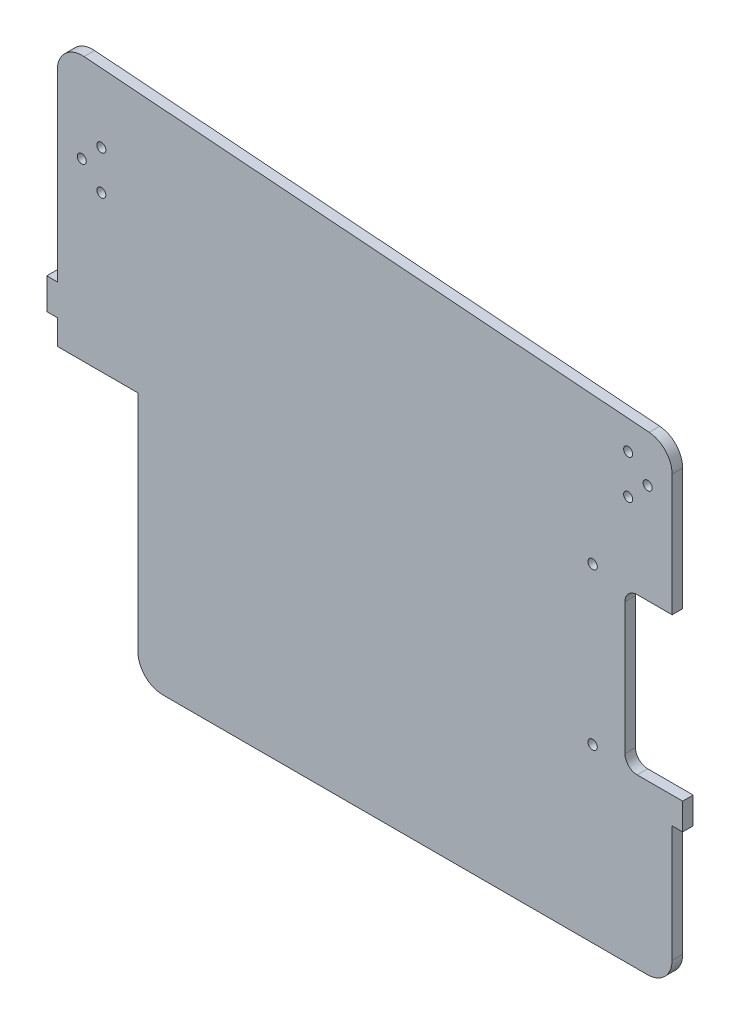
ISO-10303-21;
HEADER;
FILE_DESCRIPTION(('STEP AP214'),'2;1');
FILE_NAME('part.step','',(''),(''),'','','');
FILE_SCHEMA(('AUTOMOTIVE_DESIGN { 1 0 10303 214 1 1 1 1 }'));
ENDSEC;
DATA;
#1=APPLICATION_CONTEXT('core data for automotive mechanical design processes');
#2=APPLICATION_PROTOCOL_DEFINITION('international standard','automotive_design',2000,#1);
#3=PRODUCT_CONTEXT('',#1,'mechanical');
#4=PRODUCT('Part','Part','',(#3));
#5=PRODUCT_RELATED_PRODUCT_CATEGORY('part','',(#4));
#6=PRODUCT_DEFINITION_FORMATION('','',#4);
#7=PRODUCT_DEFINITION_CONTEXT('part definition',#1,'design');
#8=PRODUCT_DEFINITION('design','',#6,#7);
#9=PRODUCT_DEFINITION_SHAPE('','',#8);
#10=(LENGTH_UNIT() NAMED_UNIT(*) SI_UNIT(.MILLI.,.METRE.));
#11=(NAMED_UNIT(*) PLANE_ANGLE_UNIT() SI_UNIT($,.RADIAN.));
#12=(NAMED_UNIT(*) SI_UNIT($,.STERADIAN.) SOLID_ANGLE_UNIT());
#13=UNCERTAINTY_MEASURE_WITH_UNIT(LENGTH_MEASURE(1.E-05),#10,'distance_accuracy_value','');
#14=(GEOMETRIC_REPRESENTATION_CONTEXT(3) GLOBAL_UNCERTAINTY_ASSIGNED_CONTEXT((#13)) GLOBAL_UNIT_ASSIGNED_CONTEXT((#10,
#11,#12)) REPRESENTATION_CONTEXT('',''));
#15=CARTESIAN_POINT('',(0.,0.,0.));
#16=DIRECTION('',(0.,0.,1.));
#17=DIRECTION('',(1.,0.,0.));
#18=AXIS2_PLACEMENT_3D('',#15,#16,#17);
#19=CARTESIAN_POINT('',(-144.,0.,0.));
#20=DIRECTION('',(1.,0.,0.));
#21=DIRECTION('',(0.,0.,-1.));
#22=AXIS2_PLACEMENT_3D('',#19,#20,#21);
#23=PLANE('',#22);
#24=DIRECTION('',(0.,0.,1.));
#25=VECTOR('',#24,1.);
#26=CARTESIAN_POINT('',(-144.,-79.8196850776907,-17.7319898613351));
#27=LINE('',#26,#25);
#28=CARTESIAN_POINT('',(-144.,-79.8196850776907,-4.31799999999999));
#29=VERTEX_POINT('',#28);
#30=CARTESIAN_POINT('',(-144.,-79.8196850776907,0.));
#31=VERTEX_POINT('',#30);
#32=EDGE_CURVE('E221',#29,#31,#27,.T.);
#33=ORIENTED_EDGE('',*,*,#32,.F.);
#34=DIRECTION('',(0.,1.,0.));
#35=VECTOR('',#34,1.);
#36=CARTESIAN_POINT('',(-144.,-191.952333584363,-4.318));
#37=LINE('',#36,#35);
#38=CARTESIAN_POINT('',(-144.,-89.9796850776907,-4.318));
#39=VERTEX_POINT('',#38);
#40=EDGE_CURVE('E353',#39,#29,#37,.T.);
#41=ORIENTED_EDGE('',*,*,#40,.F.);
#42=DIRECTION('',(0.,0.,-1.));
#43=VECTOR('',#42,1.);
#44=CARTESIAN_POINT('',(-144.,-89.9796850776907,-4.318));
#45=LINE('',#44,#43);
#46=CARTESIAN_POINT('',(-144.,-89.9796850776907,0.));
#47=VERTEX_POINT('',#46);
#48=EDGE_CURVE('E322',#47,#39,#45,.T.);
#49=ORIENTED_EDGE('',*,*,#48,.F.);
#50=DIRECTION('',(0.,-1.,0.));
#51=VECTOR('',#50,1.);
#52=CARTESIAN_POINT('',(-144.,0.,0.));
#53=LINE('',#52,#51);
#54=EDGE_CURVE('E356',#31,#47,#53,.T.);
#55=ORIENTED_EDGE('',*,*,#54,.F.);
#56=EDGE_LOOP('',(#33,#41,#49,#55));
#57=FACE_BOUND('',#56,.T.);
#58=ADVANCED_FACE('F35',(#57),#23,.F.);
#59=CARTESIAN_POINT('',(107.682,0.,0.));
#60=DIRECTION('',(1.,0.,0.));
#61=DIRECTION('',(0.,0.,-1.));
#62=AXIS2_PLACEMENT_3D('',#59,#60,#61);
#63=PLANE('',#62);
#64=DIRECTION('',(0.,-1.,0.));
#65=VECTOR('',#64,1.);
#66=CARTESIAN_POINT('',(107.682,0.,0.));
#67=LINE('',#66,#65);
#68=CARTESIAN_POINT('',(107.682,-134.128741276363,0.));
#69=VERTEX_POINT('',#68);
#70=CARTESIAN_POINT('',(107.682,-181.792333584363,0.));
#71=VERTEX_POINT('',#70);
#72=EDGE_CURVE('E361',#69,#71,#67,.T.);
#73=ORIENTED_EDGE('',*,*,#72,.T.);
#74=DIRECTION('',(0.,0.,-1.));
#75=VECTOR('',#74,1.);
#76=CARTESIAN_POINT('',(107.682,-181.792333584363,-4.318));
#77=LINE('',#76,#75);
#78=CARTESIAN_POINT('',(107.682,-181.792333584363,-4.318));
#79=VERTEX_POINT('',#78);
#80=EDGE_CURVE('E12',#71,#79,#77,.T.);
#81=ORIENTED_EDGE('',*,*,#80,.T.);
#82=DIRECTION('',(0.,1.,0.));
#83=VECTOR('',#82,1.);
#84=CARTESIAN_POINT('',(107.682,-191.952333584363,-4.318));
#85=LINE('',#84,#83);
#86=CARTESIAN_POINT('',(107.682,-134.128741276363,-4.31799999999999));
#87=VERTEX_POINT('',#86);
#88=EDGE_CURVE('E359',#79,#87,#85,.T.);
#89=ORIENTED_EDGE('',*,*,#88,.T.);
#90=DIRECTION('',(0.,0.,1.));
#91=VECTOR('',#90,1.);
#92=CARTESIAN_POINT('',(107.682,-134.128741276363,-17.7319898613351));
#93=LINE('',#92,#91);
#94=EDGE_CURVE('E238',#87,#69,#93,.T.);
#95=ORIENTED_EDGE('',*,*,#94,.T.);
#96=EDGE_LOOP('',(#73,#81,#89,#95));
#97=FACE_BOUND('',#96,.T.);
#98=ADVANCED_FACE('F440',(#97),#63,.T.);
#99=CARTESIAN_POINT('',(107.682,-191.952333584363,0.));
#100=DIRECTION('',(0.,1.,0.));
#101=DIRECTION('',(0.,0.,1.));
#102=AXIS2_PLACEMENT_3D('',#99,#100,#101);
#103=PLANE('',#102);
#104=DIRECTION('',(-1.,0.,0.));
#105=VECTOR('',#104,1.);
#106=CARTESIAN_POINT('',(107.682,-191.952333584363,0.));
#107=LINE('',#106,#105);
#108=CARTESIAN_POINT('',(97.522,-191.952333584363,0.));
#109=VERTEX_POINT('',#108);
#110=CARTESIAN_POINT('',(-100.84,-191.952333584363,0.));
#111=VERTEX_POINT('',#110);
#112=EDGE_CURVE('E364',#109,#111,#107,.T.);
#113=ORIENTED_EDGE('',*,*,#112,.T.);
#114=DIRECTION('',(0.,0.,1.));
#115=VECTOR('',#114,1.);
#116=CARTESIAN_POINT('',(-100.84,-191.952333584363,0.));
#117=LINE('',#116,#115);
#118=CARTESIAN_POINT('',(-100.84,-191.952333584363,-4.318));
#119=VERTEX_POINT('',#118);
#120=EDGE_CURVE('E386',#111,#119,#117,.F.);
#121=ORIENTED_EDGE('',*,*,#120,.T.);
#122=DIRECTION('',(-1.,0.,0.));
#123=VECTOR('',#122,1.);
#124=CARTESIAN_POINT('',(107.682,-191.952333584363,-4.318));
#125=LINE('',#124,#123);
#126=CARTESIAN_POINT('',(97.522,-191.952333584363,-4.318));
#127=VERTEX_POINT('',#126);
#128=EDGE_CURVE('E367',#127,#119,#125,.T.);
#129=ORIENTED_EDGE('',*,*,#128,.F.);
#130=DIRECTION('',(0.,0.,-1.));
#131=VECTOR('',#130,1.);
#132=CARTESIAN_POINT('',(97.522,-191.952333584363,0.));
#133=LINE('',#132,#131);
#134=EDGE_CURVE('E384',#127,#109,#133,.F.);
#135=ORIENTED_EDGE('',*,*,#134,.T.);
#136=EDGE_LOOP('',(#113,#121,#129,#135));
#137=FACE_BOUND('',#136,.T.);
#138=ADVANCED_FACE('F448',(#137),#103,.F.);
#139=CARTESIAN_POINT('',(107.682,-191.952333584363,-4.318));
#140=DIRECTION('',(0.,0.,1.));
#141=DIRECTION('',(0.,-1.,0.));
#142=AXIS2_PLACEMENT_3D('',#139,#140,#141);
#143=PLANE('',#142);
#144=CARTESIAN_POINT('',(-134.,-18.4500000001085,-4.31799999999998));
#145=DIRECTION('',(0.,0.,1.));
#146=DIRECTION('',(0.,-1.,0.));
#147=AXIS2_PLACEMENT_3D('',#144,#145,#146);
#148=CIRCLE('',#147,1.85000000003173);
#149=CARTESIAN_POINT('',(-134.,-20.3000000001402,-4.31799999999998));
#150=VERTEX_POINT('',#149);
#151=EDGE_CURVE('E316',#150,#150,#148,.T.);
#152=ORIENTED_EDGE('',*,*,#151,.T.);
#153=EDGE_LOOP('',(#152));
#154=FACE_BOUND('',#153,.T.);
#155=CARTESIAN_POINT('',(-126.,-10.4500000001085,-4.31799999999998));
#156=DIRECTION('',(0.,0.,1.));
#157=DIRECTION('',(0.,-1.,0.));
#158=AXIS2_PLACEMENT_3D('',#155,#156,#157);
#159=CIRCLE('',#158,1.85000000003174);
#160=CARTESIAN_POINT('',(-126.,-12.3000000001402,-4.31799999999998));
#161=VERTEX_POINT('',#160);
#162=EDGE_CURVE('E313',#161,#161,#159,.T.);
#163=ORIENTED_EDGE('',*,*,#162,.T.);
#164=EDGE_LOOP('',(#163));
#165=FACE_BOUND('',#164,.T.);
#166=CARTESIAN_POINT('',(-126.,-26.4500000001085,-4.31799999999998));
#167=DIRECTION('',(0.,0.,1.));
#168=DIRECTION('',(0.,-1.,0.));
#169=AXIS2_PLACEMENT_3D('',#166,#167,#168);
#170=CIRCLE('',#169,1.85000000003171);
#171=CARTESIAN_POINT('',(-126.,-28.3000000001402,-4.31799999999998));
#172=VERTEX_POINT('',#171);
#173=EDGE_CURVE('E310',#172,#172,#170,.T.);
#174=ORIENTED_EDGE('',*,*,#173,.T.);
#175=EDGE_LOOP('',(#174));
#176=FACE_BOUND('',#175,.T.);
#177=CARTESIAN_POINT('',(89.682,-26.4500000001125,-4.31799999999998));
#178=DIRECTION('',(0.,0.,1.));
#179=DIRECTION('',(0.,-1.,0.));
#180=AXIS2_PLACEMENT_3D('',#177,#178,#179);
#181=CIRCLE('',#180,1.85000000002596);
#182=CARTESIAN_POINT('',(89.682,-28.3000000001384,-4.31799999999998));
#183=VERTEX_POINT('',#182);
#184=EDGE_CURVE('E307',#183,#183,#181,.T.);
#185=ORIENTED_EDGE('',*,*,#184,.T.);
#186=EDGE_LOOP('',(#185));
#187=FACE_BOUND('',#186,.T.);
#188=CARTESIAN_POINT('',(97.682,-18.4500000001125,-4.31799999999998));
#189=DIRECTION('',(0.,0.,1.));
#190=DIRECTION('',(0.,-1.,0.));
#191=AXIS2_PLACEMENT_3D('',#188,#189,#190);
#192=CIRCLE('',#191,1.85000000002596);
#193=CARTESIAN_POINT('',(97.682,-20.3000000001384,-4.31799999999998));
#194=VERTEX_POINT('',#193);
#195=EDGE_CURVE('E304',#194,#194,#192,.T.);
#196=ORIENTED_EDGE('',*,*,#195,.T.);
#197=EDGE_LOOP('',(#196));
#198=FACE_BOUND('',#197,.T.);
#199=CARTESIAN_POINT('',(89.682,-10.4500000001125,-4.31799999999998));
#200=DIRECTION('',(0.,0.,1.));
#201=DIRECTION('',(0.,-1.,0.));
#202=AXIS2_PLACEMENT_3D('',#199,#200,#201);
#203=CIRCLE('',#202,1.85000000002596);
#204=CARTESIAN_POINT('',(89.682,-12.3000000001384,-4.31799999999998));
#205=VERTEX_POINT('',#204);
#206=EDGE_CURVE('E301',#205,#205,#203,.T.);
#207=ORIENTED_EDGE('',*,*,#206,.T.);
#208=EDGE_LOOP('',(#207));
#209=FACE_BOUND('',#208,.T.);
#210=CARTESIAN_POINT('',(75.14500419,-121.586498411355,-4.318));
#211=DIRECTION('',(0.,0.,1.));
#212=DIRECTION('',(1.,0.,0.));
#213=AXIS2_PLACEMENT_3D('',#210,#211,#212);
#214=CIRCLE('',#213,1.90500000000001);
#215=CARTESIAN_POINT('',(77.05000419,-121.586498411355,-4.318));
#216=VERTEX_POINT('',#215);
#217=EDGE_CURVE('E341',#216,#216,#214,.T.);
#218=ORIENTED_EDGE('',*,*,#217,.T.);
#219=EDGE_LOOP('',(#218));
#220=FACE_BOUND('',#219,.T.);
#221=CARTESIAN_POINT('',(75.14500419,-57.5864984113548,-4.318));
#222=DIRECTION('',(0.,0.,1.));
#223=DIRECTION('',(1.,0.,0.));
#224=AXIS2_PLACEMENT_3D('',#221,#222,#223);
#225=CIRCLE('',#224,1.90500000000001);
#226=CARTESIAN_POINT('',(77.05000419,-57.5864984113548,-4.318));
#227=VERTEX_POINT('',#226);
#228=EDGE_CURVE('E347',#227,#227,#225,.T.);
#229=ORIENTED_EDGE('',*,*,#228,.T.);
#230=EDGE_LOOP('',(#229));
#231=FACE_BOUND('',#230,.T.);
#232=ORIENTED_EDGE('',*,*,#128,.T.);
#233=CARTESIAN_POINT('',(-100.84,-181.792333584363,-4.318));
#234=DIRECTION('',(0.,0.,1.));
#235=DIRECTION('',(0.,-1.,0.));
#236=AXIS2_PLACEMENT_3D('',#233,#234,#235);
#237=CIRCLE('',#236,10.16);
#238=CARTESIAN_POINT('',(-111.,-181.792333584363,-4.318));
#239=VERTEX_POINT('',#238);
#240=EDGE_CURVE('E393',#119,#239,#237,.F.);
#241=ORIENTED_EDGE('',*,*,#240,.T.);
#242=DIRECTION('',(0.,-1.,0.));
#243=VECTOR('',#242,1.);
#244=CARTESIAN_POINT('',(-111.,-191.952333584363,-4.318));
#245=LINE('',#244,#243);
#246=CARTESIAN_POINT('',(-111.,-89.9796850776907,-4.318));
#247=VERTEX_POINT('',#246);
#248=EDGE_CURVE('E325',#247,#239,#245,.T.);
#249=ORIENTED_EDGE('',*,*,#248,.F.);
#250=DIRECTION('',(-1.,0.,0.));
#251=VECTOR('',#250,1.);
#252=CARTESIAN_POINT('',(-111.,-89.9796850776907,-4.318));
#253=LINE('',#252,#251);
#254=EDGE_CURVE('E335',#247,#39,#253,.T.);
#255=ORIENTED_EDGE('',*,*,#254,.T.);
#256=ORIENTED_EDGE('',*,*,#40,.T.);
#257=DIRECTION('',(-1.,0.,0.));
#258=VECTOR('',#257,1.);
#259=CARTESIAN_POINT('',(-144.,-79.8196850776907,-4.31799999999999));
#260=LINE('',#259,#258);
#261=CARTESIAN_POINT('',(-148.318,-79.8196850776907,-4.31799999999999));
#262=VERTEX_POINT('',#261);
#263=EDGE_CURVE('E217',#29,#262,#260,.T.);
#264=ORIENTED_EDGE('',*,*,#263,.T.);
#265=DIRECTION('',(0.,1.,0.));
#266=VECTOR('',#265,1.);
#267=CARTESIAN_POINT('',(-148.318,-67.1196850776907,-4.31799999999998));
#268=LINE('',#267,#266);
#269=CARTESIAN_POINT('',(-148.318,-67.1196850776907,-4.31799999999998));
#270=VERTEX_POINT('',#269);
#271=EDGE_CURVE('E224',#262,#270,#268,.T.);
#272=ORIENTED_EDGE('',*,*,#271,.T.);
#273=DIRECTION('',(1.,0.,0.));
#274=VECTOR('',#273,1.);
#275=CARTESIAN_POINT('',(-144.,-67.1196850776907,-4.31799999999998));
#276=LINE('',#275,#274);
#277=CARTESIAN_POINT('',(-144.,-67.1196850776907,-4.31799999999998));
#278=VERTEX_POINT('',#277);
#279=EDGE_CURVE('E195',#270,#278,#276,.T.);
#280=ORIENTED_EDGE('',*,*,#279,.T.);
#281=CARTESIAN_POINT('',(-144.,8.09191974161541,-4.31799999999998));
#282=VERTEX_POINT('',#281);
#283=EDGE_CURVE('E350',#278,#282,#37,.T.);
#284=ORIENTED_EDGE('',*,*,#283,.T.);
#285=CARTESIAN_POINT('',(-133.84,8.09191974161547,-4.31799999999999));
#286=DIRECTION('',(0.,0.,1.));
#287=DIRECTION('',(0.,-1.,0.));
#288=AXIS2_PLACEMENT_3D('',#285,#286,#287);
#289=CIRCLE('',#288,10.16);
#290=CARTESIAN_POINT('',(-133.073175419792,18.2229404238167,-4.31799999999999));
#291=VERTEX_POINT('',#290);
#292=EDGE_CURVE('E391',#282,#291,#289,.F.);
#293=ORIENTED_EDGE('',*,*,#292,.T.);
#294=DIRECTION('',(0.997147704941064,-0.0754748602567045,0.));
#295=VECTOR('',#294,1.);
#296=CARTESIAN_POINT('',(107.682,-6.385536546433E-13,-4.31799999999999));
#297=LINE('',#296,#295);
#298=CARTESIAN_POINT('',(98.2888245802081,0.710976516981273,-4.31799999999999));
#299=VERTEX_POINT('',#298);
#300=EDGE_CURVE('E320',#291,#299,#297,.T.);
#301=ORIENTED_EDGE('',*,*,#300,.T.);
#302=CARTESIAN_POINT('',(97.522,-9.42004416521994,-4.31799999999998));
#303=DIRECTION('',(0.,0.,1.));
#304=DIRECTION('',(0.,-1.,0.));
#305=AXIS2_PLACEMENT_3D('',#302,#303,#304);
#306=CIRCLE('',#305,10.16);
#307=CARTESIAN_POINT('',(107.682,-9.42004416521999,-4.31799999999998));
#308=VERTEX_POINT('',#307);
#309=EDGE_CURVE('E50',#299,#308,#306,.F.);
#310=ORIENTED_EDGE('',*,*,#309,.T.);
#311=CARTESIAN_POINT('',(107.682,-59.3119246018148,-4.31799999999998));
#312=VERTEX_POINT('',#311);
#313=EDGE_CURVE('E358',#312,#308,#85,.T.);
#314=ORIENTED_EDGE('',*,*,#313,.F.);
#315=DIRECTION('',(-1.,0.,0.));
#316=VECTOR('',#315,1.);
#317=CARTESIAN_POINT('',(107.682,-59.3119246018148,-4.31799999999998));
#318=LINE('',#317,#316);
#319=CARTESIAN_POINT('',(93.378,-59.3119246018148,-4.31799999999998));
#320=VERTEX_POINT('',#319);
#321=EDGE_CURVE('E278',#312,#320,#318,.T.);
#322=ORIENTED_EDGE('',*,*,#321,.T.);
#323=CARTESIAN_POINT('',(93.378,-64.3119246018148,-4.31799999999998));
#324=DIRECTION('',(0.,0.,1.));
#325=DIRECTION('',(0.,-1.,0.));
#326=AXIS2_PLACEMENT_3D('',#323,#324,#325);
#327=CIRCLE('',#326,5.);
#328=CARTESIAN_POINT('',(88.378,-64.3119246018148,-4.31799999999999));
#329=VERTEX_POINT('',#328);
#330=EDGE_CURVE('E292',#320,#329,#327,.T.);
#331=ORIENTED_EDGE('',*,*,#330,.T.);
#332=DIRECTION('',(0.,-1.,0.));
#333=VECTOR('',#332,1.);
#334=CARTESIAN_POINT('',(88.378,-191.952333584363,-4.318));
#335=LINE('',#334,#333);
#336=CARTESIAN_POINT('',(88.378,-118.206741276363,-4.31799999999999));
#337=VERTEX_POINT('',#336);
#338=EDGE_CURVE('E295',#329,#337,#335,.T.);
#339=ORIENTED_EDGE('',*,*,#338,.T.);
#340=CARTESIAN_POINT('',(93.378,-118.206741276363,-4.31799999999999));
#341=DIRECTION('',(0.,0.,1.));
#342=DIRECTION('',(0.,-1.,0.));
#343=AXIS2_PLACEMENT_3D('',#340,#341,#342);
#344=CIRCLE('',#343,5.);
#345=CARTESIAN_POINT('',(93.378,-123.206741276363,-4.31799999999999));
#346=VERTEX_POINT('',#345);
#347=EDGE_CURVE('E298',#337,#346,#344,.T.);
#348=ORIENTED_EDGE('',*,*,#347,.T.);
#349=DIRECTION('',(1.,0.,0.));
#350=VECTOR('',#349,1.);
#351=CARTESIAN_POINT('',(107.682,-123.206741276363,-4.31799999999999));
#352=LINE('',#351,#350);
#353=CARTESIAN_POINT('',(112.,-123.206741276363,-4.31799999999999));
#354=VERTEX_POINT('',#353);
#355=EDGE_CURVE('E290',#346,#354,#352,.T.);
#356=ORIENTED_EDGE('',*,*,#355,.T.);
#357=DIRECTION('',(0.,-1.,0.));
#358=VECTOR('',#357,1.);
#359=CARTESIAN_POINT('',(112.,-123.206741276363,-4.31799999999999));
#360=LINE('',#359,#358);
#361=CARTESIAN_POINT('',(112.,-134.128741276363,-4.31799999999999));
#362=VERTEX_POINT('',#361);
#363=EDGE_CURVE('E229',#354,#362,#360,.T.);
#364=ORIENTED_EDGE('',*,*,#363,.T.);
#365=DIRECTION('',(-1.,0.,0.));
#366=VECTOR('',#365,1.);
#367=CARTESIAN_POINT('',(107.682,-134.128741276363,-4.31799999999999));
#368=LINE('',#367,#366);
#369=EDGE_CURVE('E231',#362,#87,#368,.T.);
#370=ORIENTED_EDGE('',*,*,#369,.T.);
#371=ORIENTED_EDGE('',*,*,#88,.F.);
#372=CARTESIAN_POINT('',(97.522,-181.792333584363,-4.318));
#373=DIRECTION('',(0.,0.,1.));
#374=DIRECTION('',(0.,-1.,0.));
#375=AXIS2_PLACEMENT_3D('',#372,#373,#374);
#376=CIRCLE('',#375,10.16);
#377=EDGE_CURVE('E388',#79,#127,#376,.F.);
#378=ORIENTED_EDGE('',*,*,#377,.T.);
#379=EDGE_LOOP('',(#232,#241,#249,#255,#256,#264,#272,#280,#284,#293,#301,#310,#314,#322,#331,
#339,#348,#356,#364,#370,#371,#378));
#380=FACE_BOUND('',#379,.T.);
#381=ADVANCED_FACE('F413',(#154,#165,#176,#187,#198,#209,#220,#231,#380),#143,.F.);
#382=CARTESIAN_POINT('',(107.682,0.,0.));
#383=DIRECTION('',(0.,0.,-1.));
#384=DIRECTION('',(0.,1.,0.));
#385=AXIS2_PLACEMENT_3D('',#382,#383,#384);
#386=PLANE('',#385);
#387=CARTESIAN_POINT('',(-134.,-18.4500000001085,0.));
#388=DIRECTION('',(0.,0.,1.));
#389=DIRECTION('',(1.,0.,0.));
#390=AXIS2_PLACEMENT_3D('',#387,#388,#389);
#391=CIRCLE('',#390,1.85000000003173);
#392=CARTESIAN_POINT('',(-132.149999999968,-18.4500000001085,0.));
#393=VERTEX_POINT('',#392);
#394=EDGE_CURVE('E247',#393,#393,#391,.T.);
#395=ORIENTED_EDGE('',*,*,#394,.F.);
#396=EDGE_LOOP('',(#395));
#397=FACE_BOUND('',#396,.T.);
#398=CARTESIAN_POINT('',(-126.,-10.4500000001085,0.));
#399=DIRECTION('',(0.,0.,1.));
#400=DIRECTION('',(1.,0.,0.));
#401=AXIS2_PLACEMENT_3D('',#398,#399,#400);
#402=CIRCLE('',#401,1.85000000003174);
#403=CARTESIAN_POINT('',(-124.149999999968,-10.4500000001085,0.));
#404=VERTEX_POINT('',#403);
#405=EDGE_CURVE('E255',#404,#404,#402,.T.);
#406=ORIENTED_EDGE('',*,*,#405,.F.);
#407=EDGE_LOOP('',(#406));
#408=FACE_BOUND('',#407,.T.);
#409=CARTESIAN_POINT('',(-126.,-26.4500000001085,0.));
#410=DIRECTION('',(0.,0.,1.));
#411=DIRECTION('',(1.,0.,0.));
#412=AXIS2_PLACEMENT_3D('',#409,#410,#411);
#413=CIRCLE('',#412,1.85000000003171);
#414=CARTESIAN_POINT('',(-124.149999999968,-26.4500000001085,0.));
#415=VERTEX_POINT('',#414);
#416=EDGE_CURVE('E252',#415,#415,#413,.T.);
#417=ORIENTED_EDGE('',*,*,#416,.F.);
#418=EDGE_LOOP('',(#417));
#419=FACE_BOUND('',#418,.T.);
#420=CARTESIAN_POINT('',(89.682,-26.4500000001125,0.));
#421=DIRECTION('',(0.,0.,1.));
#422=DIRECTION('',(1.,0.,0.));
#423=AXIS2_PLACEMENT_3D('',#420,#421,#422);
#424=CIRCLE('',#423,1.85000000002596);
#425=CARTESIAN_POINT('',(91.532000000026,-26.4500000001125,0.));
#426=VERTEX_POINT('',#425);
#427=EDGE_CURVE('E248',#426,#426,#424,.T.);
#428=ORIENTED_EDGE('',*,*,#427,.F.);
#429=EDGE_LOOP('',(#428));
#430=FACE_BOUND('',#429,.T.);
#431=CARTESIAN_POINT('',(97.682,-18.4500000001125,0.));
#432=DIRECTION('',(0.,0.,1.));
#433=DIRECTION('',(1.,0.,0.));
#434=AXIS2_PLACEMENT_3D('',#431,#432,#433);
#435=CIRCLE('',#434,1.85000000002596);
#436=CARTESIAN_POINT('',(99.532000000026,-18.4500000001125,0.));
#437=VERTEX_POINT('',#436);
#438=EDGE_CURVE('E251',#437,#437,#435,.T.);
#439=ORIENTED_EDGE('',*,*,#438,.F.);
#440=EDGE_LOOP('',(#439));
#441=FACE_BOUND('',#440,.T.);
#442=CARTESIAN_POINT('',(89.682,-10.4500000001125,0.));
#443=DIRECTION('',(0.,0.,1.));
#444=DIRECTION('',(1.,0.,0.));
#445=AXIS2_PLACEMENT_3D('',#442,#443,#444);
#446=CIRCLE('',#445,1.85000000002596);
#447=CARTESIAN_POINT('',(91.532000000026,-10.4500000001125,0.));
#448=VERTEX_POINT('',#447);
#449=EDGE_CURVE('E264',#448,#448,#446,.T.);
#450=ORIENTED_EDGE('',*,*,#449,.F.);
#451=EDGE_LOOP('',(#450));
#452=FACE_BOUND('',#451,.T.);
#453=CARTESIAN_POINT('',(75.14500419,-121.586498411355,0.));
#454=DIRECTION('',(0.,0.,1.));
#455=DIRECTION('',(1.,0.,0.));
#456=AXIS2_PLACEMENT_3D('',#453,#454,#455);
#457=CIRCLE('',#456,1.90500000000001);
#458=CARTESIAN_POINT('',(77.05000419,-121.586498411355,0.));
#459=VERTEX_POINT('',#458);
#460=EDGE_CURVE('E338',#459,#459,#457,.T.);
#461=ORIENTED_EDGE('',*,*,#460,.F.);
#462=EDGE_LOOP('',(#461));
#463=FACE_BOUND('',#462,.T.);
#464=CARTESIAN_POINT('',(75.14500419,-57.5864984113548,0.));
#465=DIRECTION('',(0.,0.,1.));
#466=DIRECTION('',(1.,0.,0.));
#467=AXIS2_PLACEMENT_3D('',#464,#465,#466);
#468=CIRCLE('',#467,1.90500000000001);
#469=CARTESIAN_POINT('',(77.05000419,-57.5864984113548,0.));
#470=VERTEX_POINT('',#469);
#471=EDGE_CURVE('E344',#470,#470,#468,.T.);
#472=ORIENTED_EDGE('',*,*,#471,.F.);
#473=EDGE_LOOP('',(#472));
#474=FACE_BOUND('',#473,.T.);
#475=DIRECTION('',(0.,1.,0.));
#476=VECTOR('',#475,1.);
#477=CARTESIAN_POINT('',(-111.,-191.952333584363,0.));
#478=LINE('',#477,#476);
#479=CARTESIAN_POINT('',(-111.,-181.792333584363,0.));
#480=VERTEX_POINT('',#479);
#481=CARTESIAN_POINT('',(-111.,-89.9796850776907,0.));
#482=VERTEX_POINT('',#481);
#483=EDGE_CURVE('E328',#480,#482,#478,.T.);
#484=ORIENTED_EDGE('',*,*,#483,.F.);
#485=CARTESIAN_POINT('',(-100.84,-181.792333584363,0.));
#486=DIRECTION('',(0.,0.,-1.));
#487=DIRECTION('',(0.,1.,0.));
#488=AXIS2_PLACEMENT_3D('',#485,#486,#487);
#489=CIRCLE('',#488,10.16);
#490=EDGE_CURVE('E382',#480,#111,#489,.F.);
#491=ORIENTED_EDGE('',*,*,#490,.T.);
#492=ORIENTED_EDGE('',*,*,#112,.F.);
#493=CARTESIAN_POINT('',(97.522,-181.792333584363,0.));
#494=DIRECTION('',(0.,0.,-1.));
#495=DIRECTION('',(0.,1.,0.));
#496=AXIS2_PLACEMENT_3D('',#493,#494,#495);
#497=CIRCLE('',#496,10.16);
#498=EDGE_CURVE('E376',#109,#71,#497,.F.);
#499=ORIENTED_EDGE('',*,*,#498,.T.);
#500=ORIENTED_EDGE('',*,*,#72,.F.);
#501=DIRECTION('',(1.,0.,0.));
#502=VECTOR('',#501,1.);
#503=CARTESIAN_POINT('',(107.682,-134.128741276363,0.));
#504=LINE('',#503,#502);
#505=CARTESIAN_POINT('',(112.,-134.128741276363,0.));
#506=VERTEX_POINT('',#505);
#507=EDGE_CURVE('E228',#69,#506,#504,.T.);
#508=ORIENTED_EDGE('',*,*,#507,.T.);
#509=DIRECTION('',(0.,1.,0.));
#510=VECTOR('',#509,1.);
#511=CARTESIAN_POINT('',(112.,-123.206741276363,0.));
#512=LINE('',#511,#510);
#513=CARTESIAN_POINT('',(112.,-123.206741276363,0.));
#514=VERTEX_POINT('',#513);
#515=EDGE_CURVE('E235',#506,#514,#512,.T.);
#516=ORIENTED_EDGE('',*,*,#515,.T.);
#517=DIRECTION('',(1.,0.,0.));
#518=VECTOR('',#517,1.);
#519=CARTESIAN_POINT('',(107.682,-123.206741276363,0.));
#520=LINE('',#519,#518);
#521=CARTESIAN_POINT('',(93.378,-123.206741276363,0.));
#522=VERTEX_POINT('',#521);
#523=EDGE_CURVE('E273',#522,#514,#520,.T.);
#524=ORIENTED_EDGE('',*,*,#523,.F.);
#525=CARTESIAN_POINT('',(93.378,-118.206741276363,0.));
#526=DIRECTION('',(0.,0.,1.));
#527=DIRECTION('',(-1.,0.,0.));
#528=AXIS2_PLACEMENT_3D('',#525,#526,#527);
#529=CIRCLE('',#528,5.);
#530=CARTESIAN_POINT('',(88.378,-118.206741276363,0.));
#531=VERTEX_POINT('',#530);
#532=EDGE_CURVE('E270',#531,#522,#529,.T.);
#533=ORIENTED_EDGE('',*,*,#532,.F.);
#534=DIRECTION('',(0.,-1.,0.));
#535=VECTOR('',#534,1.);
#536=CARTESIAN_POINT('',(88.378,-64.3119246018148,0.));
#537=LINE('',#536,#535);
#538=CARTESIAN_POINT('',(88.378,-64.3119246018148,0.));
#539=VERTEX_POINT('',#538);
#540=EDGE_CURVE('E267',#539,#531,#537,.T.);
#541=ORIENTED_EDGE('',*,*,#540,.F.);
#542=CARTESIAN_POINT('',(93.378,-64.3119246018148,0.));
#543=DIRECTION('',(0.,0.,1.));
#544=DIRECTION('',(1.,0.,0.));
#545=AXIS2_PLACEMENT_3D('',#542,#543,#544);
#546=CIRCLE('',#545,5.);
#547=CARTESIAN_POINT('',(93.378,-59.3119246018148,0.));
#548=VERTEX_POINT('',#547);
#549=EDGE_CURVE('E263',#548,#539,#546,.T.);
#550=ORIENTED_EDGE('',*,*,#549,.F.);
#551=DIRECTION('',(-1.,0.,0.));
#552=VECTOR('',#551,1.);
#553=CARTESIAN_POINT('',(107.682,-59.3119246018148,0.));
#554=LINE('',#553,#552);
#555=CARTESIAN_POINT('',(107.682,-59.3119246018148,0.));
#556=VERTEX_POINT('',#555);
#557=EDGE_CURVE('E260',#556,#548,#554,.T.);
#558=ORIENTED_EDGE('',*,*,#557,.F.);
#559=CARTESIAN_POINT('',(107.682,-9.42004416521994,0.));
#560=VERTEX_POINT('',#559);
#561=EDGE_CURVE('E362',#560,#556,#67,.T.);
#562=ORIENTED_EDGE('',*,*,#561,.F.);
#563=CARTESIAN_POINT('',(97.522,-9.42004416521994,0.));
#564=DIRECTION('',(0.,0.,-1.));
#565=DIRECTION('',(0.,1.,0.));
#566=AXIS2_PLACEMENT_3D('',#563,#564,#565);
#567=CIRCLE('',#566,10.16);
#568=CARTESIAN_POINT('',(98.2888245802081,0.710976516981273,0.));
#569=VERTEX_POINT('',#568);
#570=EDGE_CURVE('E378',#560,#569,#567,.F.);
#571=ORIENTED_EDGE('',*,*,#570,.T.);
#572=DIRECTION('',(-0.997147704941064,0.0754748602567045,0.));
#573=VECTOR('',#572,1.);
#574=CARTESIAN_POINT('',(107.682,-6.38378239159465E-13,0.));
#575=LINE('',#574,#573);
#576=CARTESIAN_POINT('',(-133.073175419792,18.2229404238167,0.));
#577=VERTEX_POINT('',#576);
#578=EDGE_CURVE('E319',#569,#577,#575,.T.);
#579=ORIENTED_EDGE('',*,*,#578,.T.);
#580=CARTESIAN_POINT('',(-133.84,8.09191974161547,0.));
#581=DIRECTION('',(0.,0.,-1.));
#582=DIRECTION('',(0.,1.,0.));
#583=AXIS2_PLACEMENT_3D('',#580,#581,#582);
#584=CIRCLE('',#583,10.16);
#585=CARTESIAN_POINT('',(-144.,8.09191974161547,0.));
#586=VERTEX_POINT('',#585);
#587=EDGE_CURVE('E380',#577,#586,#584,.F.);
#588=ORIENTED_EDGE('',*,*,#587,.T.);
#589=CARTESIAN_POINT('',(-144.,-67.1196850776907,0.));
#590=VERTEX_POINT('',#589);
#591=EDGE_CURVE('E213',#586,#590,#53,.T.);
#592=ORIENTED_EDGE('',*,*,#591,.T.);
#593=DIRECTION('',(-1.,0.,0.));
#594=VECTOR('',#593,1.);
#595=CARTESIAN_POINT('',(-144.,-67.1196850776907,0.));
#596=LINE('',#595,#594);
#597=CARTESIAN_POINT('',(-148.318,-67.1196850776907,0.));
#598=VERTEX_POINT('',#597);
#599=EDGE_CURVE('E193',#590,#598,#596,.T.);
#600=ORIENTED_EDGE('',*,*,#599,.T.);
#601=DIRECTION('',(0.,-1.,0.));
#602=VECTOR('',#601,1.);
#603=CARTESIAN_POINT('',(-148.318,-67.1196850776907,0.));
#604=LINE('',#603,#602);
#605=CARTESIAN_POINT('',(-148.318,-79.8196850776907,0.));
#606=VERTEX_POINT('',#605);
#607=EDGE_CURVE('E202',#598,#606,#604,.T.);
#608=ORIENTED_EDGE('',*,*,#607,.T.);
#609=DIRECTION('',(1.,0.,0.));
#610=VECTOR('',#609,1.);
#611=CARTESIAN_POINT('',(-144.,-79.8196850776907,0.));
#612=LINE('',#611,#610);
#613=EDGE_CURVE('E208',#606,#31,#612,.T.);
#614=ORIENTED_EDGE('',*,*,#613,.T.);
#615=ORIENTED_EDGE('',*,*,#54,.T.);
#616=DIRECTION('',(-1.,0.,0.));
#617=VECTOR('',#616,1.);
#618=CARTESIAN_POINT('',(-111.,-89.9796850776907,0.));
#619=LINE('',#618,#617);
#620=EDGE_CURVE('E333',#482,#47,#619,.T.);
#621=ORIENTED_EDGE('',*,*,#620,.F.);
#622=EDGE_LOOP('',(#484,#491,#492,#499,#500,#508,#516,#524,#533,#541,#550,#558,#562,#571,#579,
#588,#592,#600,#608,#614,#615,#621));
#623=FACE_BOUND('',#622,.T.);
#624=ADVANCED_FACE('F211',(#397,#408,#419,#430,#441,#452,#463,#474,#623),#386,.F.);
#625=ORIENTED_EDGE('',*,*,#313,.T.);
#626=DIRECTION('',(0.,0.,1.));
#627=VECTOR('',#626,1.);
#628=CARTESIAN_POINT('',(107.682,-9.42004416521994,0.));
#629=LINE('',#628,#627);
#630=EDGE_CURVE('E43',#308,#560,#629,.T.);
#631=ORIENTED_EDGE('',*,*,#630,.T.);
#632=ORIENTED_EDGE('',*,*,#561,.T.);
#633=DIRECTION('',(0.,0.,1.));
#634=VECTOR('',#633,1.);
#635=CARTESIAN_POINT('',(107.682,-59.3119246018148,0.));
#636=LINE('',#635,#634);
#637=EDGE_CURVE('E370',#312,#556,#636,.T.);
#638=ORIENTED_EDGE('',*,*,#637,.F.);
#639=EDGE_LOOP('',(#625,#631,#632,#638));
#640=FACE_BOUND('',#639,.T.);
#641=ADVANCED_FACE('F404',(#640),#63,.T.);
#642=ORIENTED_EDGE('',*,*,#591,.F.);
#643=DIRECTION('',(0.,0.,1.));
#644=VECTOR('',#643,1.);
#645=CARTESIAN_POINT('',(-144.,8.09191974161547,-4.31799999999999));
#646=LINE('',#645,#644);
#647=EDGE_CURVE('E399',#586,#282,#646,.F.);
#648=ORIENTED_EDGE('',*,*,#647,.T.);
#649=ORIENTED_EDGE('',*,*,#283,.F.);
#650=DIRECTION('',(0.,0.,1.));
#651=VECTOR('',#650,1.);
#652=CARTESIAN_POINT('',(-144.,-67.1196850776907,-17.7319898613351));
#653=LINE('',#652,#651);
#654=EDGE_CURVE('E199',#278,#590,#653,.T.);
#655=ORIENTED_EDGE('',*,*,#654,.T.);
#656=EDGE_LOOP('',(#642,#648,#649,#655));
#657=FACE_BOUND('',#656,.T.);
#658=ADVANCED_FACE('F471',(#657),#23,.F.);
#659=CARTESIAN_POINT('',(75.14500419,-57.5864984113548,-4.318));
#660=DIRECTION('',(0.,0.,1.));
#661=DIRECTION('',(1.,0.,0.));
#662=AXIS2_PLACEMENT_3D('',#659,#660,#661);
#663=CYLINDRICAL_SURFACE('',#662,1.90500000000001);
#664=ORIENTED_EDGE('',*,*,#228,.F.);
#665=EDGE_LOOP('',(#664));
#666=FACE_BOUND('',#665,.T.);
#667=ORIENTED_EDGE('',*,*,#471,.T.);
#668=EDGE_LOOP('',(#667));
#669=FACE_BOUND('',#668,.T.);
#670=ADVANCED_FACE('F492',(#666,#669),#663,.F.);
#671=CARTESIAN_POINT('',(75.14500419,-121.586498411355,-4.318));
#672=DIRECTION('',(0.,0.,1.));
#673=DIRECTION('',(1.,0.,0.));
#674=AXIS2_PLACEMENT_3D('',#671,#672,#673);
#675=CYLINDRICAL_SURFACE('',#674,1.90500000000001);
#676=ORIENTED_EDGE('',*,*,#217,.F.);
#677=EDGE_LOOP('',(#676));
#678=FACE_BOUND('',#677,.T.);
#679=ORIENTED_EDGE('',*,*,#460,.T.);
#680=EDGE_LOOP('',(#679));
#681=FACE_BOUND('',#680,.T.);
#682=ADVANCED_FACE('F497',(#678,#681),#675,.F.);
#683=CARTESIAN_POINT('',(-111.,-89.9796850776907,-4.318));
#684=DIRECTION('',(0.,1.,0.));
#685=DIRECTION('',(0.,0.,1.));
#686=AXIS2_PLACEMENT_3D('',#683,#684,#685);
#687=PLANE('',#686);
#688=ORIENTED_EDGE('',*,*,#48,.T.);
#689=ORIENTED_EDGE('',*,*,#254,.F.);
#690=DIRECTION('',(0.,0.,-1.));
#691=VECTOR('',#690,1.);
#692=CARTESIAN_POINT('',(-111.,-89.9796850776907,-4.318));
#693=LINE('',#692,#691);
#694=EDGE_CURVE('E330',#482,#247,#693,.T.);
#695=ORIENTED_EDGE('',*,*,#694,.F.);
#696=ORIENTED_EDGE('',*,*,#620,.T.);
#697=EDGE_LOOP('',(#688,#689,#695,#696));
#698=FACE_BOUND('',#697,.T.);
#699=ADVANCED_FACE('F461',(#698),#687,.F.);
#700=CARTESIAN_POINT('',(-111.,0.,0.));
#701=DIRECTION('',(1.,0.,0.));
#702=DIRECTION('',(0.,0.,-1.));
#703=AXIS2_PLACEMENT_3D('',#700,#701,#702);
#704=PLANE('',#703);
#705=ORIENTED_EDGE('',*,*,#248,.T.);
#706=DIRECTION('',(0.,0.,1.));
#707=VECTOR('',#706,1.);
#708=CARTESIAN_POINT('',(-111.,-181.792333584363,0.));
#709=LINE('',#708,#707);
#710=EDGE_CURVE('E373',#239,#480,#709,.T.);
#711=ORIENTED_EDGE('',*,*,#710,.T.);
#712=ORIENTED_EDGE('',*,*,#483,.T.);
#713=ORIENTED_EDGE('',*,*,#694,.T.);
#714=EDGE_LOOP('',(#705,#711,#712,#713));
#715=FACE_BOUND('',#714,.T.);
#716=ADVANCED_FACE('F457',(#715),#704,.F.);
#717=CARTESIAN_POINT('',(107.682,-6.38378239159465E-13,-256.719924762867));
#718=DIRECTION('',(0.0754748602567045,0.997147704941064,0.));
#719=DIRECTION('',(-0.997147704941064,0.0754748602567045,0.));
#720=AXIS2_PLACEMENT_3D('',#717,#718,#719);
#721=PLANE('',#720);
#722=ORIENTED_EDGE('',*,*,#300,.F.);
#723=DIRECTION('',(0.,0.,1.));
#724=VECTOR('',#723,1.);
#725=CARTESIAN_POINT('',(-133.073175419792,18.2229404238167,0.));
#726=LINE('',#725,#724);
#727=EDGE_CURVE('E396',#291,#577,#726,.T.);
#728=ORIENTED_EDGE('',*,*,#727,.T.);
#729=ORIENTED_EDGE('',*,*,#578,.F.);
#730=DIRECTION('',(0.,0.,1.));
#731=VECTOR('',#730,1.);
#732=CARTESIAN_POINT('',(98.2888245802081,0.710976516981273,-256.719924762867));
#733=LINE('',#732,#731);
#734=EDGE_CURVE('E58',#569,#299,#733,.F.);
#735=ORIENTED_EDGE('',*,*,#734,.T.);
#736=EDGE_LOOP('',(#722,#728,#729,#735));
#737=FACE_BOUND('',#736,.T.);
#738=ADVANCED_FACE('F476',(#737),#721,.T.);
#739=CARTESIAN_POINT('',(93.378,-118.206741276363,-5.08));
#740=DIRECTION('',(0.,0.,1.));
#741=DIRECTION('',(1.,0.,0.));
#742=AXIS2_PLACEMENT_3D('',#739,#740,#741);
#743=CYLINDRICAL_SURFACE('',#742,5.);
#744=DIRECTION('',(0.,0.,1.));
#745=VECTOR('',#744,1.);
#746=CARTESIAN_POINT('',(88.378,-118.206741276363,-5.08));
#747=LINE('',#746,#745);
#748=EDGE_CURVE('E279',#337,#531,#747,.T.);
#749=ORIENTED_EDGE('',*,*,#748,.T.);
#750=ORIENTED_EDGE('',*,*,#532,.T.);
#751=DIRECTION('',(0.,0.,1.));
#752=VECTOR('',#751,1.);
#753=CARTESIAN_POINT('',(93.378,-123.206741276363,-5.08));
#754=LINE('',#753,#752);
#755=EDGE_CURVE('E276',#346,#522,#754,.T.);
#756=ORIENTED_EDGE('',*,*,#755,.F.);
#757=ORIENTED_EDGE('',*,*,#347,.F.);
#758=EDGE_LOOP('',(#749,#750,#756,#757));
#759=FACE_BOUND('',#758,.T.);
#760=ADVANCED_FACE('F422',(#759),#743,.F.);
#761=CARTESIAN_POINT('',(88.378,-64.3119246018148,-5.08));
#762=DIRECTION('',(-1.,0.,0.));
#763=DIRECTION('',(0.,0.,1.));
#764=AXIS2_PLACEMENT_3D('',#761,#762,#763);
#765=PLANE('',#764);
#766=DIRECTION('',(0.,0.,1.));
#767=VECTOR('',#766,1.);
#768=CARTESIAN_POINT('',(88.378,-64.3119246018148,-5.08));
#769=LINE('',#768,#767);
#770=EDGE_CURVE('E281',#329,#539,#769,.T.);
#771=ORIENTED_EDGE('',*,*,#770,.T.);
#772=ORIENTED_EDGE('',*,*,#540,.T.);
#773=ORIENTED_EDGE('',*,*,#748,.F.);
#774=ORIENTED_EDGE('',*,*,#338,.F.);
#775=EDGE_LOOP('',(#771,#772,#773,#774));
#776=FACE_BOUND('',#775,.T.);
#777=ADVANCED_FACE('F418',(#776),#765,.F.);
#778=CARTESIAN_POINT('',(93.378,-64.3119246018148,-5.08));
#779=DIRECTION('',(0.,0.,1.));
#780=DIRECTION('',(1.,0.,0.));
#781=AXIS2_PLACEMENT_3D('',#778,#779,#780);
#782=CYLINDRICAL_SURFACE('',#781,5.);
#783=DIRECTION('',(0.,0.,1.));
#784=VECTOR('',#783,1.);
#785=CARTESIAN_POINT('',(93.378,-59.3119246018148,-5.08));
#786=LINE('',#785,#784);
#787=EDGE_CURVE('E275',#320,#548,#786,.T.);
#788=ORIENTED_EDGE('',*,*,#787,.T.);
#789=ORIENTED_EDGE('',*,*,#549,.T.);
#790=ORIENTED_EDGE('',*,*,#770,.F.);
#791=ORIENTED_EDGE('',*,*,#330,.F.);
#792=EDGE_LOOP('',(#788,#789,#790,#791));
#793=FACE_BOUND('',#792,.T.);
#794=ADVANCED_FACE('F416',(#793),#782,.F.);
#795=CARTESIAN_POINT('',(107.682,-123.206741276363,-5.08));
#796=DIRECTION('',(0.,-1.,0.));
#797=DIRECTION('',(0.,0.,-1.));
#798=AXIS2_PLACEMENT_3D('',#795,#796,#797);
#799=PLANE('',#798);
#800=ORIENTED_EDGE('',*,*,#755,.T.);
#801=ORIENTED_EDGE('',*,*,#523,.T.);
#802=DIRECTION('',(0.,0.,1.));
#803=VECTOR('',#802,1.);
#804=CARTESIAN_POINT('',(112.,-123.206741276363,-17.7319898613351));
#805=LINE('',#804,#803);
#806=EDGE_CURVE('E232',#354,#514,#805,.T.);
#807=ORIENTED_EDGE('',*,*,#806,.F.);
#808=ORIENTED_EDGE('',*,*,#355,.F.);
#809=EDGE_LOOP('',(#800,#801,#807,#808));
#810=FACE_BOUND('',#809,.T.);
#811=ADVANCED_FACE('F433',(#810),#799,.F.);
#812=CARTESIAN_POINT('',(107.682,-59.3119246018148,-5.08));
#813=DIRECTION('',(0.,1.,0.));
#814=DIRECTION('',(0.,0.,1.));
#815=AXIS2_PLACEMENT_3D('',#812,#813,#814);
#816=PLANE('',#815);
#817=ORIENTED_EDGE('',*,*,#637,.T.);
#818=ORIENTED_EDGE('',*,*,#557,.T.);
#819=ORIENTED_EDGE('',*,*,#787,.F.);
#820=ORIENTED_EDGE('',*,*,#321,.F.);
#821=EDGE_LOOP('',(#817,#818,#819,#820));
#822=FACE_BOUND('',#821,.T.);
#823=ADVANCED_FACE('F412',(#822),#816,.F.);
#824=CARTESIAN_POINT('',(89.682,-10.4500000001125,-5.08));
#825=DIRECTION('',(0.,0.,1.));
#826=DIRECTION('',(1.,0.,0.));
#827=AXIS2_PLACEMENT_3D('',#824,#825,#826);
#828=CYLINDRICAL_SURFACE('',#827,1.85000000002596);
#829=ORIENTED_EDGE('',*,*,#449,.T.);
#830=EDGE_LOOP('',(#829));
#831=FACE_BOUND('',#830,.T.);
#832=ORIENTED_EDGE('',*,*,#206,.F.);
#833=EDGE_LOOP('',(#832));
#834=FACE_BOUND('',#833,.T.);
#835=ADVANCED_FACE('F552',(#831,#834),#828,.F.);
#836=CARTESIAN_POINT('',(97.682,-18.4500000001125,-5.08));
#837=DIRECTION('',(0.,0.,1.));
#838=DIRECTION('',(1.,0.,0.));
#839=AXIS2_PLACEMENT_3D('',#836,#837,#838);
#840=CYLINDRICAL_SURFACE('',#839,1.85000000002596);
#841=ORIENTED_EDGE('',*,*,#438,.T.);
#842=EDGE_LOOP('',(#841));
#843=FACE_BOUND('',#842,.T.);
#844=ORIENTED_EDGE('',*,*,#195,.F.);
#845=EDGE_LOOP('',(#844));
#846=FACE_BOUND('',#845,.T.);
#847=ADVANCED_FACE('F530',(#843,#846),#840,.F.);
#848=CARTESIAN_POINT('',(89.682,-26.4500000001125,-5.08));
#849=DIRECTION('',(0.,0.,1.));
#850=DIRECTION('',(1.,0.,0.));
#851=AXIS2_PLACEMENT_3D('',#848,#849,#850);
#852=CYLINDRICAL_SURFACE('',#851,1.85000000002596);
#853=ORIENTED_EDGE('',*,*,#427,.T.);
#854=EDGE_LOOP('',(#853));
#855=FACE_BOUND('',#854,.T.);
#856=ORIENTED_EDGE('',*,*,#184,.F.);
#857=EDGE_LOOP('',(#856));
#858=FACE_BOUND('',#857,.T.);
#859=ADVANCED_FACE('F526',(#855,#858),#852,.F.);
#860=CARTESIAN_POINT('',(-126.,-26.4500000001085,-5.08));
#861=DIRECTION('',(0.,0.,1.));
#862=DIRECTION('',(1.,0.,0.));
#863=AXIS2_PLACEMENT_3D('',#860,#861,#862);
#864=CYLINDRICAL_SURFACE('',#863,1.85000000003171);
#865=ORIENTED_EDGE('',*,*,#416,.T.);
#866=EDGE_LOOP('',(#865));
#867=FACE_BOUND('',#866,.T.);
#868=ORIENTED_EDGE('',*,*,#173,.F.);
#869=EDGE_LOOP('',(#868));
#870=FACE_BOUND('',#869,.T.);
#871=ADVANCED_FACE('F529',(#867,#870),#864,.F.);
#872=CARTESIAN_POINT('',(-126.,-10.4500000001085,-5.08));
#873=DIRECTION('',(0.,0.,1.));
#874=DIRECTION('',(1.,0.,0.));
#875=AXIS2_PLACEMENT_3D('',#872,#873,#874);
#876=CYLINDRICAL_SURFACE('',#875,1.85000000003174);
#877=ORIENTED_EDGE('',*,*,#405,.T.);
#878=EDGE_LOOP('',(#877));
#879=FACE_BOUND('',#878,.T.);
#880=ORIENTED_EDGE('',*,*,#162,.F.);
#881=EDGE_LOOP('',(#880));
#882=FACE_BOUND('',#881,.T.);
#883=ADVANCED_FACE('F534',(#879,#882),#876,.F.);
#884=CARTESIAN_POINT('',(-134.,-18.4500000001085,-5.08));
#885=DIRECTION('',(0.,0.,1.));
#886=DIRECTION('',(1.,0.,0.));
#887=AXIS2_PLACEMENT_3D('',#884,#885,#886);
#888=CYLINDRICAL_SURFACE('',#887,1.85000000003173);
#889=ORIENTED_EDGE('',*,*,#394,.T.);
#890=EDGE_LOOP('',(#889));
#891=FACE_BOUND('',#890,.T.);
#892=ORIENTED_EDGE('',*,*,#151,.F.);
#893=EDGE_LOOP('',(#892));
#894=FACE_BOUND('',#893,.T.);
#895=ADVANCED_FACE('F523',(#891,#894),#888,.F.);
#896=CARTESIAN_POINT('',(112.,-123.206741276363,-17.7319898613351));
#897=DIRECTION('',(1.,0.,0.));
#898=DIRECTION('',(0.,0.,-1.));
#899=AXIS2_PLACEMENT_3D('',#896,#897,#898);
#900=PLANE('',#899);
#901=ORIENTED_EDGE('',*,*,#363,.F.);
#902=ORIENTED_EDGE('',*,*,#806,.T.);
#903=ORIENTED_EDGE('',*,*,#515,.F.);
#904=DIRECTION('',(0.,0.,1.));
#905=VECTOR('',#904,1.);
#906=CARTESIAN_POINT('',(112.,-134.128741276363,-17.7319898613351));
#907=LINE('',#906,#905);
#908=EDGE_CURVE('E241',#362,#506,#907,.T.);
#909=ORIENTED_EDGE('',*,*,#908,.F.);
#910=EDGE_LOOP('',(#901,#902,#903,#909));
#911=FACE_BOUND('',#910,.T.);
#912=ADVANCED_FACE('F430',(#911),#900,.T.);
#913=CARTESIAN_POINT('',(107.682,-134.128741276363,-17.7319898613351));
#914=DIRECTION('',(0.,-1.,0.));
#915=DIRECTION('',(0.,0.,-1.));
#916=AXIS2_PLACEMENT_3D('',#913,#914,#915);
#917=PLANE('',#916);
#918=ORIENTED_EDGE('',*,*,#369,.F.);
#919=ORIENTED_EDGE('',*,*,#908,.T.);
#920=ORIENTED_EDGE('',*,*,#507,.F.);
#921=ORIENTED_EDGE('',*,*,#94,.F.);
#922=EDGE_LOOP('',(#918,#919,#920,#921));
#923=FACE_BOUND('',#922,.T.);
#924=ADVANCED_FACE('F438',(#923),#917,.T.);
#925=CARTESIAN_POINT('',(-144.,-79.8196850776907,-17.7319898613351));
#926=DIRECTION('',(0.,-1.,0.));
#927=DIRECTION('',(0.,0.,-1.));
#928=AXIS2_PLACEMENT_3D('',#925,#926,#927);
#929=PLANE('',#928);
#930=ORIENTED_EDGE('',*,*,#263,.F.);
#931=ORIENTED_EDGE('',*,*,#32,.T.);
#932=ORIENTED_EDGE('',*,*,#613,.F.);
#933=DIRECTION('',(0.,0.,1.));
#934=VECTOR('',#933,1.);
#935=CARTESIAN_POINT('',(-148.318,-79.8196850776907,-17.7319898613351));
#936=LINE('',#935,#934);
#937=EDGE_CURVE('E198',#262,#606,#936,.T.);
#938=ORIENTED_EDGE('',*,*,#937,.F.);
#939=EDGE_LOOP('',(#930,#931,#932,#938));
#940=FACE_BOUND('',#939,.T.);
#941=ADVANCED_FACE('F467',(#940),#929,.T.);
#942=CARTESIAN_POINT('',(-148.318,-67.1196850776907,-17.7319898613351));
#943=DIRECTION('',(-1.,0.,0.));
#944=DIRECTION('',(0.,0.,1.));
#945=AXIS2_PLACEMENT_3D('',#942,#943,#944);
#946=PLANE('',#945);
#947=ORIENTED_EDGE('',*,*,#271,.F.);
#948=ORIENTED_EDGE('',*,*,#937,.T.);
#949=ORIENTED_EDGE('',*,*,#607,.F.);
#950=DIRECTION('',(0.,0.,1.));
#951=VECTOR('',#950,1.);
#952=CARTESIAN_POINT('',(-148.318,-67.1196850776907,-17.7319898613351));
#953=LINE('',#952,#951);
#954=EDGE_CURVE('E188',#270,#598,#953,.T.);
#955=ORIENTED_EDGE('',*,*,#954,.F.);
#956=EDGE_LOOP('',(#947,#948,#949,#955));
#957=FACE_BOUND('',#956,.T.);
#958=ADVANCED_FACE('F203',(#957),#946,.T.);
#959=CARTESIAN_POINT('',(-144.,-67.1196850776907,-17.7319898613351));
#960=DIRECTION('',(0.,1.,0.));
#961=DIRECTION('',(0.,0.,1.));
#962=AXIS2_PLACEMENT_3D('',#959,#960,#961);
#963=PLANE('',#962);
#964=ORIENTED_EDGE('',*,*,#279,.F.);
#965=ORIENTED_EDGE('',*,*,#954,.T.);
#966=ORIENTED_EDGE('',*,*,#599,.F.);
#967=ORIENTED_EDGE('',*,*,#654,.F.);
#968=EDGE_LOOP('',(#964,#965,#966,#967));
#969=FACE_BOUND('',#968,.T.);
#970=ADVANCED_FACE('F190',(#969),#963,.T.);
#971=CARTESIAN_POINT('',(-100.84,-181.792333584363,0.));
#972=DIRECTION('',(0.,0.,1.));
#973=DIRECTION('',(1.,0.,0.));
#974=AXIS2_PLACEMENT_3D('',#971,#972,#973);
#975=CYLINDRICAL_SURFACE('',#974,10.16);
#976=ORIENTED_EDGE('',*,*,#240,.F.);
#977=ORIENTED_EDGE('',*,*,#120,.F.);
#978=ORIENTED_EDGE('',*,*,#490,.F.);
#979=ORIENTED_EDGE('',*,*,#710,.F.);
#980=EDGE_LOOP('',(#976,#977,#978,#979));
#981=FACE_BOUND('',#980,.T.);
#982=ADVANCED_FACE('F453',(#981),#975,.T.);
#983=CARTESIAN_POINT('',(-133.84,8.09191974161547,-256.719924762867));
#984=DIRECTION('',(0.,0.,-1.));
#985=DIRECTION('',(-1.,0.,0.));
#986=AXIS2_PLACEMENT_3D('',#983,#984,#985);
#987=CYLINDRICAL_SURFACE('',#986,10.16);
#988=ORIENTED_EDGE('',*,*,#292,.F.);
#989=ORIENTED_EDGE('',*,*,#647,.F.);
#990=ORIENTED_EDGE('',*,*,#587,.F.);
#991=ORIENTED_EDGE('',*,*,#727,.F.);
#992=EDGE_LOOP('',(#988,#989,#990,#991));
#993=FACE_BOUND('',#992,.T.);
#994=ADVANCED_FACE('F474',(#993),#987,.T.);
#995=CARTESIAN_POINT('',(97.522,-9.42004416521994,0.));
#996=DIRECTION('',(0.,0.,1.));
#997=DIRECTION('',(1.,0.,0.));
#998=AXIS2_PLACEMENT_3D('',#995,#996,#997);
#999=CYLINDRICAL_SURFACE('',#998,10.16);
#1000=ORIENTED_EDGE('',*,*,#309,.F.);
#1001=ORIENTED_EDGE('',*,*,#734,.F.);
#1002=ORIENTED_EDGE('',*,*,#570,.F.);
#1003=ORIENTED_EDGE('',*,*,#630,.F.);
#1004=EDGE_LOOP('',(#1000,#1001,#1002,#1003));
#1005=FACE_BOUND('',#1004,.T.);
#1006=ADVANCED_FACE('F477',(#1005),#999,.T.);
#1007=CARTESIAN_POINT('',(97.522,-181.792333584363,0.));
#1008=DIRECTION('',(0.,0.,1.));
#1009=DIRECTION('',(1.,0.,0.));
#1010=AXIS2_PLACEMENT_3D('',#1007,#1008,#1009);
#1011=CYLINDRICAL_SURFACE('',#1010,10.16);
#1012=ORIENTED_EDGE('',*,*,#498,.F.);
#1013=ORIENTED_EDGE('',*,*,#134,.F.);
#1014=ORIENTED_EDGE('',*,*,#377,.F.);
#1015=ORIENTED_EDGE('',*,*,#80,.F.);
#1016=EDGE_LOOP('',(#1012,#1013,#1014,#1015));
#1017=FACE_BOUND('',#1016,.T.);
#1018=ADVANCED_FACE('F37',(#1017),#1011,.T.);
#1019=CLOSED_SHELL('',(#58,#98,#138,#381,#624,#641,#658,#670,#682,#699,#716,#738,#760,#777,#794,
#811,#823,#835,#847,#859,#871,#883,#895,#912,#924,#941,#958,#970,#982,#994,#1006,#1018));
#1020=MANIFOLD_SOLID_BREP('B2',#1019);
#1021=ADVANCED_BREP_SHAPE_REPRESENTATION('',(#18,#1020),#14);
#1022=SHAPE_DEFINITION_REPRESENTATION(#9,#1021);
ENDSEC;
END-ISO-10303-21;
